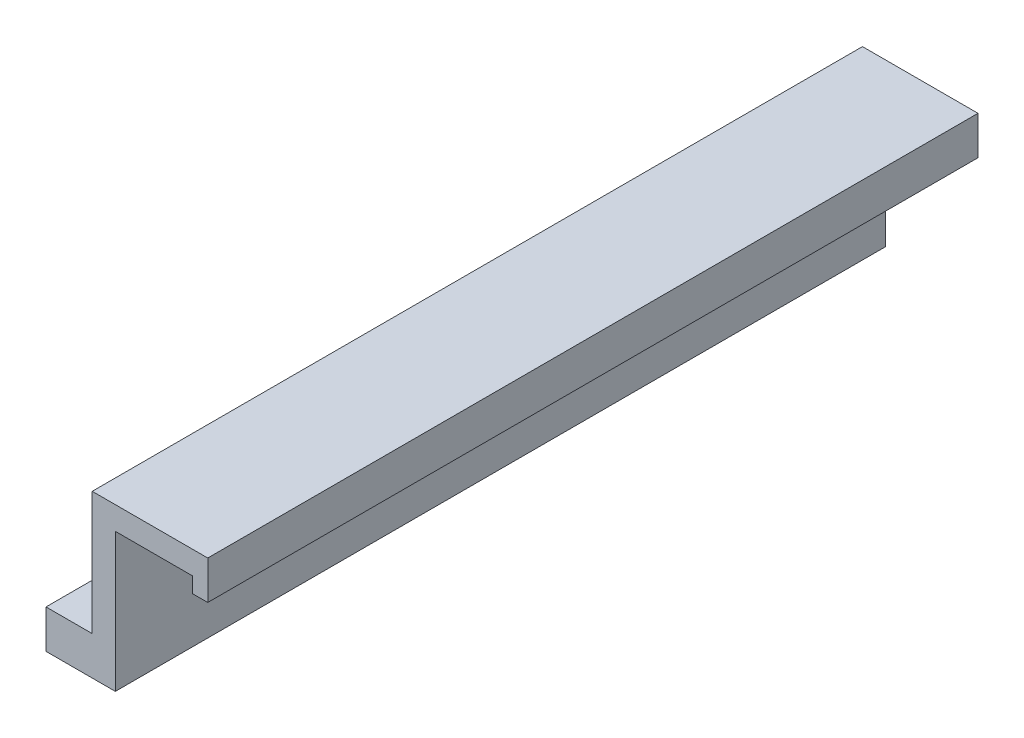
ISO-10303-21;
HEADER;
FILE_DESCRIPTION(('STEP AP214'),'2;1');
FILE_NAME('part.step','',(''),(''),'','','');
FILE_SCHEMA(('AUTOMOTIVE_DESIGN { 1 0 10303 214 1 1 1 1 }'));
ENDSEC;
DATA;
#1=APPLICATION_CONTEXT('core data for automotive mechanical design processes');
#2=APPLICATION_PROTOCOL_DEFINITION('international standard','automotive_design',2000,#1);
#3=PRODUCT_CONTEXT('',#1,'mechanical');
#4=PRODUCT('Part','Part','',(#3));
#5=PRODUCT_RELATED_PRODUCT_CATEGORY('part','',(#4));
#6=PRODUCT_DEFINITION_FORMATION('','',#4);
#7=PRODUCT_DEFINITION_CONTEXT('part definition',#1,'design');
#8=PRODUCT_DEFINITION('design','',#6,#7);
#9=PRODUCT_DEFINITION_SHAPE('','',#8);
#10=(LENGTH_UNIT() NAMED_UNIT(*) SI_UNIT(.MILLI.,.METRE.));
#11=(NAMED_UNIT(*) PLANE_ANGLE_UNIT() SI_UNIT($,.RADIAN.));
#12=(NAMED_UNIT(*) SI_UNIT($,.STERADIAN.) SOLID_ANGLE_UNIT());
#13=UNCERTAINTY_MEASURE_WITH_UNIT(LENGTH_MEASURE(1.E-05),#10,'distance_accuracy_value','');
#14=(GEOMETRIC_REPRESENTATION_CONTEXT(3) GLOBAL_UNCERTAINTY_ASSIGNED_CONTEXT((#13)) GLOBAL_UNIT_ASSIGNED_CONTEXT((#10,
#11,#12)) REPRESENTATION_CONTEXT('',''));
#15=CARTESIAN_POINT('',(0.,0.,0.));
#16=DIRECTION('',(0.,0.,1.));
#17=DIRECTION('',(1.,0.,0.));
#18=AXIS2_PLACEMENT_3D('',#15,#16,#17);
#19=CARTESIAN_POINT('',(0.,0.,0.));
#20=DIRECTION('',(1.,0.,0.));
#21=DIRECTION('',(0.,0.,1.));
#22=AXIS2_PLACEMENT_3D('',#19,#20,#21);
#23=PLANE('',#22);
#24=DIRECTION('',(0.,-1.,0.));
#25=VECTOR('',#24,1.);
#26=CARTESIAN_POINT('',(0.,55.921439864012,-57.5));
#27=LINE('',#26,#25);
#28=CARTESIAN_POINT('',(0.,13.,-57.5));
#29=VERTEX_POINT('',#28);
#30=CARTESIAN_POINT('',(0.,11.5,-57.5));
#31=VERTEX_POINT('',#30);
#32=EDGE_CURVE('E221',#29,#31,#27,.T.);
#33=ORIENTED_EDGE('',*,*,#32,.T.);
#34=DIRECTION('',(0.,0.,-1.));
#35=VECTOR('',#34,1.);
#36=CARTESIAN_POINT('',(0.,11.5,0.));
#37=LINE('',#36,#35);
#38=CARTESIAN_POINT('',(0.,11.5,-42.5));
#39=VERTEX_POINT('',#38);
#40=EDGE_CURVE('E187',#39,#31,#37,.T.);
#41=ORIENTED_EDGE('',*,*,#40,.F.);
#42=DIRECTION('',(0.,-1.,0.));
#43=VECTOR('',#42,1.);
#44=CARTESIAN_POINT('',(0.,55.921439864012,-42.5));
#45=LINE('',#44,#43);
#46=CARTESIAN_POINT('',(0.,13.,-42.5));
#47=VERTEX_POINT('',#46);
#48=EDGE_CURVE('E193',#47,#39,#45,.T.);
#49=ORIENTED_EDGE('',*,*,#48,.F.);
#50=DIRECTION('',(0.,0.,-1.));
#51=VECTOR('',#50,1.);
#52=CARTESIAN_POINT('',(0.,13.,0.));
#53=LINE('',#52,#51);
#54=CARTESIAN_POINT('',(0.,13.,0.));
#55=VERTEX_POINT('',#54);
#56=EDGE_CURVE('E122',#55,#47,#53,.T.);
#57=ORIENTED_EDGE('',*,*,#56,.F.);
#58=DIRECTION('',(0.,-1.,0.));
#59=VECTOR('',#58,1.);
#60=CARTESIAN_POINT('',(0.,0.,0.));
#61=LINE('',#60,#59);
#62=CARTESIAN_POINT('',(0.,29.,0.));
#63=VERTEX_POINT('',#62);
#64=EDGE_CURVE('E49',#63,#55,#61,.T.);
#65=ORIENTED_EDGE('',*,*,#64,.F.);
#66=DIRECTION('',(0.,0.,1.));
#67=VECTOR('',#66,1.);
#68=CARTESIAN_POINT('',(0.,29.,0.));
#69=LINE('',#68,#67);
#70=CARTESIAN_POINT('',(0.,29.,-100.));
#71=VERTEX_POINT('',#70);
#72=EDGE_CURVE('E43',#71,#63,#69,.T.);
#73=ORIENTED_EDGE('',*,*,#72,.F.);
#74=DIRECTION('',(0.,1.,0.));
#75=VECTOR('',#74,1.);
#76=CARTESIAN_POINT('',(0.,0.,-100.));
#77=LINE('',#76,#75);
#78=CARTESIAN_POINT('',(0.,13.,-100.));
#79=VERTEX_POINT('',#78);
#80=EDGE_CURVE('E12',#79,#71,#77,.T.);
#81=ORIENTED_EDGE('',*,*,#80,.F.);
#82=DIRECTION('',(0.,0.,1.));
#83=VECTOR('',#82,1.);
#84=CARTESIAN_POINT('',(0.,13.,-100.));
#85=LINE('',#84,#83);
#86=EDGE_CURVE('E206',#79,#29,#85,.T.);
#87=ORIENTED_EDGE('',*,*,#86,.T.);
#88=EDGE_LOOP('',(#33,#41,#49,#57,#65,#73,#81,#87));
#89=FACE_BOUND('',#88,.T.);
#90=ADVANCED_FACE('F39',(#89),#23,.F.);
#91=CARTESIAN_POINT('',(-34.5,11.5,-65.));
#92=DIRECTION('',(0.,1.,0.));
#93=DIRECTION('',(0.,0.,1.));
#94=AXIS2_PLACEMENT_3D('',#91,#92,#93);
#95=PLANE('',#94);
#96=ORIENTED_EDGE('',*,*,#40,.T.);
#97=DIRECTION('',(1.,0.,0.));
#98=VECTOR('',#97,1.);
#99=CARTESIAN_POINT('',(-6.,11.5,-57.5));
#100=LINE('',#99,#98);
#101=CARTESIAN_POINT('',(-6.,11.5,-57.5));
#102=VERTEX_POINT('',#101);
#103=EDGE_CURVE('E212',#102,#31,#100,.T.);
#104=ORIENTED_EDGE('',*,*,#103,.F.);
#105=DIRECTION('',(0.,0.,1.));
#106=VECTOR('',#105,1.);
#107=CARTESIAN_POINT('',(-6.,11.5,-100.));
#108=LINE('',#107,#106);
#109=CARTESIAN_POINT('',(-6.,11.5,-42.5));
#110=VERTEX_POINT('',#109);
#111=EDGE_CURVE('E188',#102,#110,#108,.T.);
#112=ORIENTED_EDGE('',*,*,#111,.T.);
#113=DIRECTION('',(1.,0.,0.));
#114=VECTOR('',#113,1.);
#115=CARTESIAN_POINT('',(-6.,11.5,-42.5));
#116=LINE('',#115,#114);
#117=EDGE_CURVE('E201',#110,#39,#116,.T.);
#118=ORIENTED_EDGE('',*,*,#117,.T.);
#119=EDGE_LOOP('',(#96,#104,#112,#118));
#120=FACE_BOUND('',#119,.T.);
#121=ADVANCED_FACE('F329',(#120),#95,.T.);
#122=CARTESIAN_POINT('',(2.,0.,0.));
#123=DIRECTION('',(0.,0.,-1.));
#124=DIRECTION('',(1.,0.,0.));
#125=AXIS2_PLACEMENT_3D('',#122,#123,#124);
#126=PLANE('',#125);
#127=DIRECTION('',(0.,-1.,0.));
#128=VECTOR('',#127,1.);
#129=CARTESIAN_POINT('',(3.,0.,0.));
#130=LINE('',#129,#128);
#131=CARTESIAN_POINT('',(3.,26.,0.));
#132=VERTEX_POINT('',#131);
#133=CARTESIAN_POINT('',(3.,8.,0.));
#134=VERTEX_POINT('',#133);
#135=EDGE_CURVE('E151',#132,#134,#130,.T.);
#136=ORIENTED_EDGE('',*,*,#135,.F.);
#137=DIRECTION('',(-1.,0.,0.));
#138=VECTOR('',#137,1.);
#139=CARTESIAN_POINT('',(14.,26.,0.));
#140=LINE('',#139,#138);
#141=CARTESIAN_POINT('',(13.,26.,0.));
#142=VERTEX_POINT('',#141);
#143=EDGE_CURVE('E133',#142,#132,#140,.T.);
#144=ORIENTED_EDGE('',*,*,#143,.F.);
#145=DIRECTION('',(0.,1.,0.));
#146=VECTOR('',#145,1.);
#147=CARTESIAN_POINT('',(13.,24.,0.));
#148=LINE('',#147,#146);
#149=CARTESIAN_POINT('',(13.,24.,0.));
#150=VERTEX_POINT('',#149);
#151=EDGE_CURVE('E117',#150,#142,#148,.T.);
#152=ORIENTED_EDGE('',*,*,#151,.F.);
#153=DIRECTION('',(-1.,0.,0.));
#154=VECTOR('',#153,1.);
#155=CARTESIAN_POINT('',(16.,24.,0.));
#156=LINE('',#155,#154);
#157=CARTESIAN_POINT('',(15.,24.,0.));
#158=VERTEX_POINT('',#157);
#159=EDGE_CURVE('E134',#158,#150,#156,.T.);
#160=ORIENTED_EDGE('',*,*,#159,.F.);
#161=DIRECTION('',(0.,-1.,0.));
#162=VECTOR('',#161,1.);
#163=CARTESIAN_POINT('',(15.,28.,0.));
#164=LINE('',#163,#162);
#165=CARTESIAN_POINT('',(15.,29.,0.));
#166=VERTEX_POINT('',#165);
#167=EDGE_CURVE('E132',#166,#158,#164,.T.);
#168=ORIENTED_EDGE('',*,*,#167,.F.);
#169=DIRECTION('',(1.,0.,0.));
#170=VECTOR('',#169,1.);
#171=CARTESIAN_POINT('',(2.,29.,0.));
#172=LINE('',#171,#170);
#173=EDGE_CURVE('E110',#63,#166,#172,.T.);
#174=ORIENTED_EDGE('',*,*,#173,.F.);
#175=ORIENTED_EDGE('',*,*,#64,.T.);
#176=DIRECTION('',(1.,0.,0.));
#177=VECTOR('',#176,1.);
#178=CARTESIAN_POINT('',(-6.,13.,0.));
#179=LINE('',#178,#177);
#180=CARTESIAN_POINT('',(-6.,13.,0.));
#181=VERTEX_POINT('',#180);
#182=EDGE_CURVE('E203',#181,#55,#179,.T.);
#183=ORIENTED_EDGE('',*,*,#182,.F.);
#184=DIRECTION('',(0.,1.,0.));
#185=VECTOR('',#184,1.);
#186=CARTESIAN_POINT('',(-6.,0.,0.));
#187=LINE('',#186,#185);
#188=CARTESIAN_POINT('',(-6.,8.,0.));
#189=VERTEX_POINT('',#188);
#190=EDGE_CURVE('E170',#189,#181,#187,.T.);
#191=ORIENTED_EDGE('',*,*,#190,.F.);
#192=DIRECTION('',(-1.,0.,0.));
#193=VECTOR('',#192,1.);
#194=CARTESIAN_POINT('',(104.079968025574,8.,0.));
#195=LINE('',#194,#193);
#196=EDGE_CURVE('E167',#134,#189,#195,.T.);
#197=ORIENTED_EDGE('',*,*,#196,.F.);
#198=EDGE_LOOP('',(#136,#144,#152,#160,#168,#174,#175,#183,#191,#197));
#199=FACE_BOUND('',#198,.T.);
#200=ADVANCED_FACE('F129',(#199),#126,.F.);
#201=CARTESIAN_POINT('',(2.,0.,-100.));
#202=DIRECTION('',(0.,0.,1.));
#203=DIRECTION('',(-1.,0.,0.));
#204=AXIS2_PLACEMENT_3D('',#201,#202,#203);
#205=PLANE('',#204);
#206=DIRECTION('',(1.,0.,0.));
#207=VECTOR('',#206,1.);
#208=CARTESIAN_POINT('',(-6.,13.,-100.));
#209=LINE('',#208,#207);
#210=CARTESIAN_POINT('',(-6.,13.,-100.));
#211=VERTEX_POINT('',#210);
#212=EDGE_CURVE('E218',#211,#79,#209,.T.);
#213=ORIENTED_EDGE('',*,*,#212,.T.);
#214=ORIENTED_EDGE('',*,*,#80,.T.);
#215=DIRECTION('',(-1.,0.,0.));
#216=VECTOR('',#215,1.);
#217=CARTESIAN_POINT('',(2.,29.,-100.));
#218=LINE('',#217,#216);
#219=CARTESIAN_POINT('',(15.,29.,-100.));
#220=VERTEX_POINT('',#219);
#221=EDGE_CURVE('E113',#220,#71,#218,.T.);
#222=ORIENTED_EDGE('',*,*,#221,.F.);
#223=DIRECTION('',(0.,1.,0.));
#224=VECTOR('',#223,1.);
#225=CARTESIAN_POINT('',(15.,28.,-100.));
#226=LINE('',#225,#224);
#227=CARTESIAN_POINT('',(15.,24.,-100.));
#228=VERTEX_POINT('',#227);
#229=EDGE_CURVE('E143',#228,#220,#226,.T.);
#230=ORIENTED_EDGE('',*,*,#229,.F.);
#231=DIRECTION('',(1.,0.,0.));
#232=VECTOR('',#231,1.);
#233=CARTESIAN_POINT('',(16.,24.,-100.));
#234=LINE('',#233,#232);
#235=CARTESIAN_POINT('',(13.,24.,-100.));
#236=VERTEX_POINT('',#235);
#237=EDGE_CURVE('E162',#236,#228,#234,.T.);
#238=ORIENTED_EDGE('',*,*,#237,.F.);
#239=DIRECTION('',(0.,-1.,0.));
#240=VECTOR('',#239,1.);
#241=CARTESIAN_POINT('',(13.,24.,-100.));
#242=LINE('',#241,#240);
#243=CARTESIAN_POINT('',(13.,26.,-100.));
#244=VERTEX_POINT('',#243);
#245=EDGE_CURVE('E160',#244,#236,#242,.T.);
#246=ORIENTED_EDGE('',*,*,#245,.F.);
#247=DIRECTION('',(1.,0.,0.));
#248=VECTOR('',#247,1.);
#249=CARTESIAN_POINT('',(14.,26.,-100.));
#250=LINE('',#249,#248);
#251=CARTESIAN_POINT('',(3.,26.,-100.));
#252=VERTEX_POINT('',#251);
#253=EDGE_CURVE('E154',#252,#244,#250,.T.);
#254=ORIENTED_EDGE('',*,*,#253,.F.);
#255=DIRECTION('',(0.,1.,0.));
#256=VECTOR('',#255,1.);
#257=CARTESIAN_POINT('',(3.,0.,-100.));
#258=LINE('',#257,#256);
#259=CARTESIAN_POINT('',(3.,8.,-100.));
#260=VERTEX_POINT('',#259);
#261=EDGE_CURVE('E148',#260,#252,#258,.T.);
#262=ORIENTED_EDGE('',*,*,#261,.F.);
#263=DIRECTION('',(-1.,0.,0.));
#264=VECTOR('',#263,1.);
#265=CARTESIAN_POINT('',(2.,8.,-100.));
#266=LINE('',#265,#264);
#267=CARTESIAN_POINT('',(-6.,8.,-100.));
#268=VERTEX_POINT('',#267);
#269=EDGE_CURVE('E147',#260,#268,#266,.T.);
#270=ORIENTED_EDGE('',*,*,#269,.T.);
#271=DIRECTION('',(0.,-1.,0.));
#272=VECTOR('',#271,1.);
#273=CARTESIAN_POINT('',(-6.,0.,-100.));
#274=LINE('',#273,#272);
#275=EDGE_CURVE('E174',#211,#268,#274,.T.);
#276=ORIENTED_EDGE('',*,*,#275,.F.);
#277=EDGE_LOOP('',(#213,#214,#222,#230,#238,#246,#254,#262,#270,#276));
#278=FACE_BOUND('',#277,.T.);
#279=ADVANCED_FACE('F295',(#278),#205,.F.);
#280=CARTESIAN_POINT('',(3.,0.,0.));
#281=DIRECTION('',(1.,0.,0.));
#282=DIRECTION('',(0.,0.,1.));
#283=AXIS2_PLACEMENT_3D('',#280,#281,#282);
#284=PLANE('',#283);
#285=ORIENTED_EDGE('',*,*,#135,.T.);
#286=DIRECTION('',(0.,0.,-1.));
#287=VECTOR('',#286,1.);
#288=CARTESIAN_POINT('',(3.,8.,0.));
#289=LINE('',#288,#287);
#290=EDGE_CURVE('E137',#134,#260,#289,.T.);
#291=ORIENTED_EDGE('',*,*,#290,.T.);
#292=ORIENTED_EDGE('',*,*,#261,.T.);
#293=DIRECTION('',(0.,0.,1.));
#294=VECTOR('',#293,1.);
#295=CARTESIAN_POINT('',(3.,26.,0.));
#296=LINE('',#295,#294);
#297=EDGE_CURVE('E126',#252,#132,#296,.T.);
#298=ORIENTED_EDGE('',*,*,#297,.T.);
#299=EDGE_LOOP('',(#285,#291,#292,#298));
#300=FACE_BOUND('',#299,.T.);
#301=ADVANCED_FACE('F305',(#300),#284,.T.);
#302=CARTESIAN_POINT('',(14.,26.,-114.560219778561));
#303=DIRECTION('',(0.,-1.,0.));
#304=DIRECTION('',(0.,0.,-1.));
#305=AXIS2_PLACEMENT_3D('',#302,#303,#304);
#306=PLANE('',#305);
#307=ORIENTED_EDGE('',*,*,#253,.T.);
#308=DIRECTION('',(0.,0.,1.));
#309=VECTOR('',#308,1.);
#310=CARTESIAN_POINT('',(13.,26.,-114.560219778561));
#311=LINE('',#310,#309);
#312=EDGE_CURVE('E144',#244,#142,#311,.T.);
#313=ORIENTED_EDGE('',*,*,#312,.T.);
#314=ORIENTED_EDGE('',*,*,#143,.T.);
#315=ORIENTED_EDGE('',*,*,#297,.F.);
#316=EDGE_LOOP('',(#307,#313,#314,#315));
#317=FACE_BOUND('',#316,.T.);
#318=ADVANCED_FACE('F308',(#317),#306,.T.);
#319=CARTESIAN_POINT('',(13.,24.,-114.560219778561));
#320=DIRECTION('',(-1.,0.,0.));
#321=DIRECTION('',(0.,1.,0.));
#322=AXIS2_PLACEMENT_3D('',#319,#320,#321);
#323=PLANE('',#322);
#324=ORIENTED_EDGE('',*,*,#245,.T.);
#325=DIRECTION('',(0.,0.,1.));
#326=VECTOR('',#325,1.);
#327=CARTESIAN_POINT('',(13.,24.,-114.560219778561));
#328=LINE('',#327,#326);
#329=EDGE_CURVE('E155',#236,#150,#328,.T.);
#330=ORIENTED_EDGE('',*,*,#329,.T.);
#331=ORIENTED_EDGE('',*,*,#151,.T.);
#332=ORIENTED_EDGE('',*,*,#312,.F.);
#333=EDGE_LOOP('',(#324,#330,#331,#332));
#334=FACE_BOUND('',#333,.T.);
#335=ADVANCED_FACE('F311',(#334),#323,.T.);
#336=CARTESIAN_POINT('',(16.,24.,-114.560219778561));
#337=DIRECTION('',(0.,-1.,0.));
#338=DIRECTION('',(0.,0.,-1.));
#339=AXIS2_PLACEMENT_3D('',#336,#337,#338);
#340=PLANE('',#339);
#341=ORIENTED_EDGE('',*,*,#237,.T.);
#342=DIRECTION('',(0.,0.,1.));
#343=VECTOR('',#342,1.);
#344=CARTESIAN_POINT('',(15.,24.,-114.560219778561));
#345=LINE('',#344,#343);
#346=EDGE_CURVE('E141',#228,#158,#345,.T.);
#347=ORIENTED_EDGE('',*,*,#346,.T.);
#348=ORIENTED_EDGE('',*,*,#159,.T.);
#349=ORIENTED_EDGE('',*,*,#329,.F.);
#350=EDGE_LOOP('',(#341,#347,#348,#349));
#351=FACE_BOUND('',#350,.T.);
#352=ADVANCED_FACE('F315',(#351),#340,.T.);
#353=CARTESIAN_POINT('',(15.,28.,-114.560219778561));
#354=DIRECTION('',(1.,0.,0.));
#355=DIRECTION('',(0.,0.,1.));
#356=AXIS2_PLACEMENT_3D('',#353,#354,#355);
#357=PLANE('',#356);
#358=ORIENTED_EDGE('',*,*,#229,.T.);
#359=DIRECTION('',(0.,0.,1.));
#360=VECTOR('',#359,1.);
#361=CARTESIAN_POINT('',(15.,29.,-114.560219778561));
#362=LINE('',#361,#360);
#363=EDGE_CURVE('E116',#220,#166,#362,.T.);
#364=ORIENTED_EDGE('',*,*,#363,.T.);
#365=ORIENTED_EDGE('',*,*,#167,.T.);
#366=ORIENTED_EDGE('',*,*,#346,.F.);
#367=EDGE_LOOP('',(#358,#364,#365,#366));
#368=FACE_BOUND('',#367,.T.);
#369=ADVANCED_FACE('F317',(#368),#357,.T.);
#370=CARTESIAN_POINT('',(2.,29.,-114.560219778561));
#371=DIRECTION('',(0.,1.,0.));
#372=DIRECTION('',(0.,0.,1.));
#373=AXIS2_PLACEMENT_3D('',#370,#371,#372);
#374=PLANE('',#373);
#375=ORIENTED_EDGE('',*,*,#221,.T.);
#376=ORIENTED_EDGE('',*,*,#72,.T.);
#377=ORIENTED_EDGE('',*,*,#173,.T.);
#378=ORIENTED_EDGE('',*,*,#363,.F.);
#379=EDGE_LOOP('',(#375,#376,#377,#378));
#380=FACE_BOUND('',#379,.T.);
#381=ADVANCED_FACE('F41',(#380),#374,.T.);
#382=CARTESIAN_POINT('',(104.079968025574,8.,0.));
#383=DIRECTION('',(0.,1.,0.));
#384=DIRECTION('',(0.,0.,1.));
#385=AXIS2_PLACEMENT_3D('',#382,#383,#384);
#386=PLANE('',#385);
#387=CARTESIAN_POINT('',(-3.,8.,-33.2832094200999));
#388=DIRECTION('',(0.,1.,0.));
#389=DIRECTION('',(0.,0.,1.));
#390=AXIS2_PLACEMENT_3D('',#387,#388,#389);
#391=CIRCLE('',#390,1.75);
#392=CARTESIAN_POINT('',(-3.,8.,-31.5332094200999));
#393=VERTEX_POINT('',#392);
#394=EDGE_CURVE('E226',#393,#393,#391,.T.);
#395=ORIENTED_EDGE('',*,*,#394,.T.);
#396=EDGE_LOOP('',(#395));
#397=FACE_BOUND('',#396,.T.);
#398=CARTESIAN_POINT('',(-3.,8.,-65.85));
#399=DIRECTION('',(0.,1.,0.));
#400=DIRECTION('',(0.,0.,1.));
#401=AXIS2_PLACEMENT_3D('',#398,#399,#400);
#402=CIRCLE('',#401,1.75);
#403=CARTESIAN_POINT('',(-3.,8.,-64.1));
#404=VERTEX_POINT('',#403);
#405=EDGE_CURVE('E232',#404,#404,#402,.T.);
#406=ORIENTED_EDGE('',*,*,#405,.T.);
#407=EDGE_LOOP('',(#406));
#408=FACE_BOUND('',#407,.T.);
#409=ORIENTED_EDGE('',*,*,#290,.F.);
#410=ORIENTED_EDGE('',*,*,#196,.T.);
#411=DIRECTION('',(0.,0.,1.));
#412=VECTOR('',#411,1.);
#413=CARTESIAN_POINT('',(-6.00000000000001,8.,0.));
#414=LINE('',#413,#412);
#415=EDGE_CURVE('E171',#268,#189,#414,.T.);
#416=ORIENTED_EDGE('',*,*,#415,.F.);
#417=ORIENTED_EDGE('',*,*,#269,.F.);
#418=EDGE_LOOP('',(#409,#410,#416,#417));
#419=FACE_BOUND('',#418,.T.);
#420=ADVANCED_FACE('F241',(#397,#408,#419),#386,.F.);
#421=CARTESIAN_POINT('',(-6.,0.,0.));
#422=DIRECTION('',(-1.,0.,0.));
#423=DIRECTION('',(0.,0.,1.));
#424=AXIS2_PLACEMENT_3D('',#421,#422,#423);
#425=PLANE('',#424);
#426=ORIENTED_EDGE('',*,*,#275,.T.);
#427=ORIENTED_EDGE('',*,*,#415,.T.);
#428=ORIENTED_EDGE('',*,*,#190,.T.);
#429=DIRECTION('',(0.,0.,-1.));
#430=VECTOR('',#429,1.);
#431=CARTESIAN_POINT('',(-6.,13.,0.));
#432=LINE('',#431,#430);
#433=CARTESIAN_POINT('',(-6.,13.,-42.5));
#434=VERTEX_POINT('',#433);
#435=EDGE_CURVE('E196',#181,#434,#432,.T.);
#436=ORIENTED_EDGE('',*,*,#435,.T.);
#437=DIRECTION('',(0.,-1.,0.));
#438=VECTOR('',#437,1.);
#439=CARTESIAN_POINT('',(-6.,55.921439864012,-42.5));
#440=LINE('',#439,#438);
#441=EDGE_CURVE('E198',#434,#110,#440,.T.);
#442=ORIENTED_EDGE('',*,*,#441,.T.);
#443=ORIENTED_EDGE('',*,*,#111,.F.);
#444=DIRECTION('',(0.,-1.,0.));
#445=VECTOR('',#444,1.);
#446=CARTESIAN_POINT('',(-6.,55.921439864012,-57.5));
#447=LINE('',#446,#445);
#448=CARTESIAN_POINT('',(-6.,13.,-57.5));
#449=VERTEX_POINT('',#448);
#450=EDGE_CURVE('E58',#449,#102,#447,.T.);
#451=ORIENTED_EDGE('',*,*,#450,.F.);
#452=DIRECTION('',(0.,0.,1.));
#453=VECTOR('',#452,1.);
#454=CARTESIAN_POINT('',(-6.,13.,-100.));
#455=LINE('',#454,#453);
#456=EDGE_CURVE('E214',#211,#449,#455,.T.);
#457=ORIENTED_EDGE('',*,*,#456,.F.);
#458=EDGE_LOOP('',(#426,#427,#428,#436,#442,#443,#451,#457));
#459=FACE_BOUND('',#458,.T.);
#460=ADVANCED_FACE('F269',(#459),#425,.T.);
#461=CARTESIAN_POINT('',(-6.,55.921439864012,-42.5));
#462=DIRECTION('',(0.,0.,-1.));
#463=DIRECTION('',(-1.,0.,0.));
#464=AXIS2_PLACEMENT_3D('',#461,#462,#463);
#465=PLANE('',#464);
#466=ORIENTED_EDGE('',*,*,#441,.F.);
#467=DIRECTION('',(1.,0.,0.));
#468=VECTOR('',#467,1.);
#469=CARTESIAN_POINT('',(-6.,13.,-42.5));
#470=LINE('',#469,#468);
#471=EDGE_CURVE('E197',#434,#47,#470,.T.);
#472=ORIENTED_EDGE('',*,*,#471,.T.);
#473=ORIENTED_EDGE('',*,*,#48,.T.);
#474=ORIENTED_EDGE('',*,*,#117,.F.);
#475=EDGE_LOOP('',(#466,#472,#473,#474));
#476=FACE_BOUND('',#475,.T.);
#477=ADVANCED_FACE('F255',(#476),#465,.T.);
#478=CARTESIAN_POINT('',(-136.841459727634,13.,0.));
#479=DIRECTION('',(0.,1.,0.));
#480=DIRECTION('',(0.,0.,1.));
#481=AXIS2_PLACEMENT_3D('',#478,#479,#480);
#482=PLANE('',#481);
#483=CARTESIAN_POINT('',(-3.,13.,-33.2832094200999));
#484=DIRECTION('',(0.,1.,0.));
#485=DIRECTION('',(0.,0.,1.));
#486=AXIS2_PLACEMENT_3D('',#483,#484,#485);
#487=CIRCLE('',#486,1.75);
#488=CARTESIAN_POINT('',(-3.,13.,-31.5332094200999));
#489=VERTEX_POINT('',#488);
#490=EDGE_CURVE('E235',#489,#489,#487,.T.);
#491=ORIENTED_EDGE('',*,*,#490,.F.);
#492=EDGE_LOOP('',(#491));
#493=FACE_BOUND('',#492,.T.);
#494=ORIENTED_EDGE('',*,*,#471,.F.);
#495=ORIENTED_EDGE('',*,*,#435,.F.);
#496=ORIENTED_EDGE('',*,*,#182,.T.);
#497=ORIENTED_EDGE('',*,*,#56,.T.);
#498=EDGE_LOOP('',(#494,#495,#496,#497));
#499=FACE_BOUND('',#498,.T.);
#500=ADVANCED_FACE('F251',(#493,#499),#482,.T.);
#501=CARTESIAN_POINT('',(-6.,55.921439864012,-57.5));
#502=DIRECTION('',(0.,0.,-1.));
#503=DIRECTION('',(-1.,0.,0.));
#504=AXIS2_PLACEMENT_3D('',#501,#502,#503);
#505=PLANE('',#504);
#506=DIRECTION('',(1.,0.,0.));
#507=VECTOR('',#506,1.);
#508=CARTESIAN_POINT('',(-6.,13.,-57.5));
#509=LINE('',#508,#507);
#510=EDGE_CURVE('E217',#449,#29,#509,.T.);
#511=ORIENTED_EDGE('',*,*,#510,.F.);
#512=ORIENTED_EDGE('',*,*,#450,.T.);
#513=ORIENTED_EDGE('',*,*,#103,.T.);
#514=ORIENTED_EDGE('',*,*,#32,.F.);
#515=EDGE_LOOP('',(#511,#512,#513,#514));
#516=FACE_BOUND('',#515,.T.);
#517=ADVANCED_FACE('F254',(#516),#505,.F.);
#518=CARTESIAN_POINT('',(-136.841459727634,13.,0.));
#519=DIRECTION('',(0.,1.,0.));
#520=DIRECTION('',(0.,0.,1.));
#521=AXIS2_PLACEMENT_3D('',#518,#519,#520);
#522=PLANE('',#521);
#523=CARTESIAN_POINT('',(-3.,13.,-65.85));
#524=DIRECTION('',(0.,1.,0.));
#525=DIRECTION('',(0.,0.,1.));
#526=AXIS2_PLACEMENT_3D('',#523,#524,#525);
#527=CIRCLE('',#526,1.75);
#528=CARTESIAN_POINT('',(-3.,13.,-64.1));
#529=VERTEX_POINT('',#528);
#530=EDGE_CURVE('E229',#529,#529,#527,.T.);
#531=ORIENTED_EDGE('',*,*,#530,.F.);
#532=EDGE_LOOP('',(#531));
#533=FACE_BOUND('',#532,.T.);
#534=ORIENTED_EDGE('',*,*,#86,.F.);
#535=ORIENTED_EDGE('',*,*,#212,.F.);
#536=ORIENTED_EDGE('',*,*,#456,.T.);
#537=ORIENTED_EDGE('',*,*,#510,.T.);
#538=EDGE_LOOP('',(#534,#535,#536,#537));
#539=FACE_BOUND('',#538,.T.);
#540=ADVANCED_FACE('F291',(#533,#539),#522,.T.);
#541=CARTESIAN_POINT('',(-3.,8.,-65.85));
#542=DIRECTION('',(0.,1.,0.));
#543=DIRECTION('',(0.,0.,1.));
#544=AXIS2_PLACEMENT_3D('',#541,#542,#543);
#545=CYLINDRICAL_SURFACE('',#544,1.75);
#546=ORIENTED_EDGE('',*,*,#405,.F.);
#547=EDGE_LOOP('',(#546));
#548=FACE_BOUND('',#547,.T.);
#549=ORIENTED_EDGE('',*,*,#530,.T.);
#550=EDGE_LOOP('',(#549));
#551=FACE_BOUND('',#550,.T.);
#552=ADVANCED_FACE('F247',(#548,#551),#545,.F.);
#553=CARTESIAN_POINT('',(-3.,8.,-33.2832094200999));
#554=DIRECTION('',(0.,1.,0.));
#555=DIRECTION('',(0.,0.,1.));
#556=AXIS2_PLACEMENT_3D('',#553,#554,#555);
#557=CYLINDRICAL_SURFACE('',#556,1.75);
#558=ORIENTED_EDGE('',*,*,#394,.F.);
#559=EDGE_LOOP('',(#558));
#560=FACE_BOUND('',#559,.T.);
#561=ORIENTED_EDGE('',*,*,#490,.T.);
#562=EDGE_LOOP('',(#561));
#563=FACE_BOUND('',#562,.T.);
#564=ADVANCED_FACE('F244',(#560,#563),#557,.F.);
#565=CLOSED_SHELL('',(#90,#121,#200,#279,#301,#318,#335,#352,#369,#381,#420,#460,#477,#500,#517,
#540,#552,#564));
#566=MANIFOLD_SOLID_BREP('B2',#565);
#567=ADVANCED_BREP_SHAPE_REPRESENTATION('',(#18,#566),#14);
#568=SHAPE_DEFINITION_REPRESENTATION(#9,#567);
ENDSEC;
END-ISO-10303-21;
